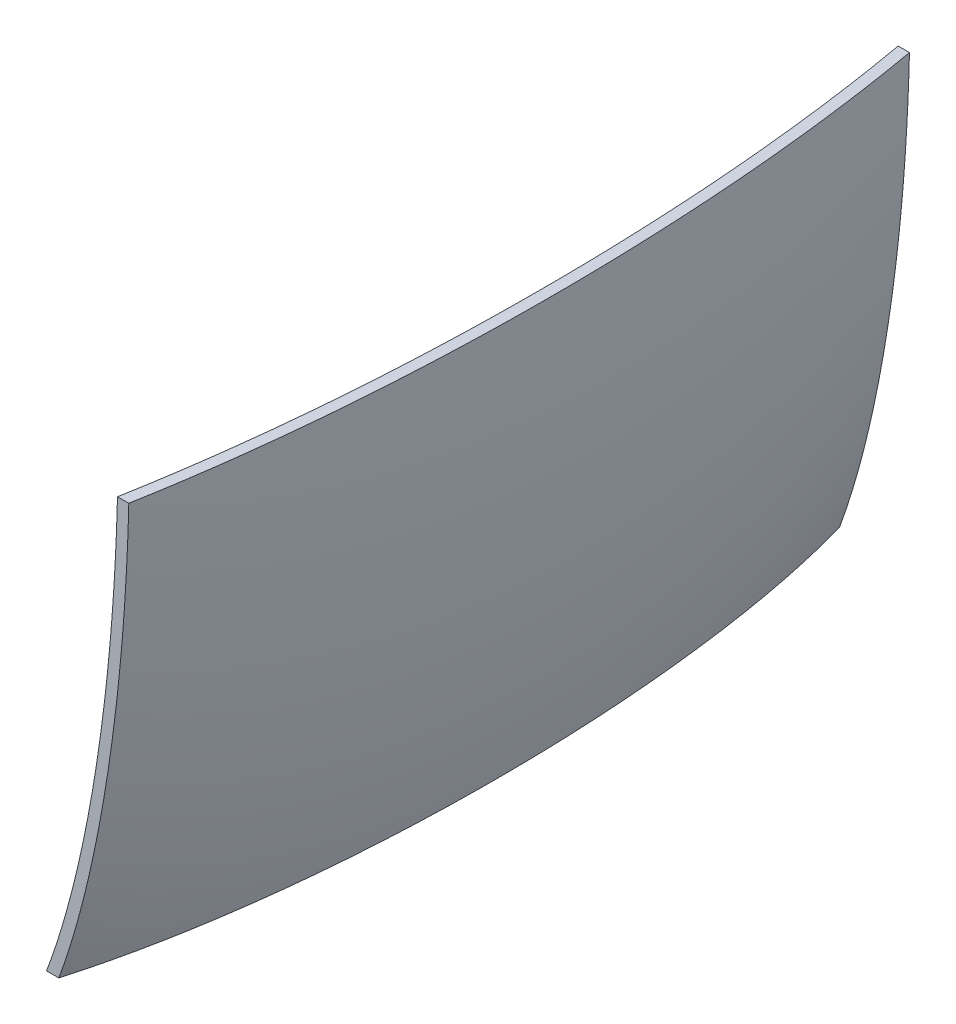
ISO-10303-21;
HEADER;
FILE_DESCRIPTION(('STEP AP214'),'2;1');
FILE_NAME('part.step','',(''),(''),'','','');
FILE_SCHEMA(('AUTOMOTIVE_DESIGN { 1 0 10303 214 1 1 1 1 }'));
ENDSEC;
DATA;
#1=APPLICATION_CONTEXT('core data for automotive mechanical design processes');
#2=APPLICATION_PROTOCOL_DEFINITION('international standard','automotive_design',2000,#1);
#3=PRODUCT_CONTEXT('',#1,'mechanical');
#4=PRODUCT('Part','Part','',(#3));
#5=PRODUCT_RELATED_PRODUCT_CATEGORY('part','',(#4));
#6=PRODUCT_DEFINITION_FORMATION('','',#4);
#7=PRODUCT_DEFINITION_CONTEXT('part definition',#1,'design');
#8=PRODUCT_DEFINITION('design','',#6,#7);
#9=PRODUCT_DEFINITION_SHAPE('','',#8);
#10=(LENGTH_UNIT() NAMED_UNIT(*) SI_UNIT(.MILLI.,.METRE.));
#11=(NAMED_UNIT(*) PLANE_ANGLE_UNIT() SI_UNIT($,.RADIAN.));
#12=(NAMED_UNIT(*) SI_UNIT($,.STERADIAN.) SOLID_ANGLE_UNIT());
#13=UNCERTAINTY_MEASURE_WITH_UNIT(LENGTH_MEASURE(1.E-05),#10,'distance_accuracy_value','');
#14=(GEOMETRIC_REPRESENTATION_CONTEXT(3) GLOBAL_UNCERTAINTY_ASSIGNED_CONTEXT((#13)) GLOBAL_UNIT_ASSIGNED_CONTEXT((#10,
#11,#12)) REPRESENTATION_CONTEXT('',''));
#15=CARTESIAN_POINT('',(0.,0.,0.));
#16=DIRECTION('',(0.,0.,1.));
#17=DIRECTION('',(1.,0.,0.));
#18=AXIS2_PLACEMENT_3D('',#15,#16,#17);
#19=CARTESIAN_POINT('',(-19.558,0.,0.));
#20=DIRECTION('',(0.,0.,1.));
#21=DIRECTION('',(0.,1.,0.));
#22=AXIS2_PLACEMENT_3D('',#19,#20,#21);
#23=ELLIPSE('',#22,66.929,19.558);
#24=TRIMMED_CURVE('',#23,(PARAMETER_VALUE(1.5707963267949)),(PARAMETER_VALUE(4.71238898038469)),
.T.,.PARAMETER.);
#25=CARTESIAN_POINT('',(-78.994,0.,0.));
#26=DIRECTION('',(-1.,0.,0.));
#27=AXIS1_PLACEMENT('',#25,#26);
#28=SURFACE_OF_REVOLUTION('',#24,#27);
#29=CARTESIAN_POINT('',(-2.95153679059233,-5.,35.));
#30=CARTESIAN_POINT('',(-2.97274859129977,-5.8246109817068,35.));
#31=CARTESIAN_POINT('',(-2.9992219123988,-6.64908921805449,35.));
#32=CARTESIAN_POINT('',(-3.06290342518978,-8.29842447092255,35.));
#33=CARTESIAN_POINT('',(-3.1001219131156,-9.12328108952281,35.));
#34=CARTESIAN_POINT('',(-3.18549616066032,-10.7730234993551,35.));
#35=CARTESIAN_POINT('',(-3.23365975722108,-11.5979088859634,35.));
#36=CARTESIAN_POINT('',(-3.34119709188108,-13.2473532917202,35.));
#37=CARTESIAN_POINT('',(-3.40057627681239,-14.0719119564002,35.));
#38=CARTESIAN_POINT('',(-3.53087605682866,-15.7203439422262,35.));
#39=CARTESIAN_POINT('',(-3.60179978132468,-16.5442170164923,35.));
#40=CARTESIAN_POINT('',(-3.75559398786525,-18.1909141672776,35.));
#41=CARTESIAN_POINT('',(-3.83846539580471,-19.0137381575069,35.));
#42=CARTESIAN_POINT('',(-4.01572527241899,-20.649462569734,35.));
#43=CARTESIAN_POINT('',(-4.10998456539371,-21.4623769631639,35.));
#44=CARTESIAN_POINT('',(-4.31127060887084,-23.0865037743427,35.));
#45=CARTESIAN_POINT('',(-4.41829544724528,-23.8977164285148,35.));
#46=CARTESIAN_POINT('',(-4.64581935100373,-25.5180765872359,35.));
#47=CARTESIAN_POINT('',(-4.76631551482277,-26.3272244982506,35.));
#48=CARTESIAN_POINT('',(-5.02164430456594,-27.9430689598173,35.));
#49=CARTESIAN_POINT('',(-5.15647358867276,-28.7497660368706,35.));
#50=CARTESIAN_POINT('',(-5.44152961985443,-30.3602882151227,35.));
#51=CARTESIAN_POINT('',(-5.59175353677753,-31.1641138161954,35.));
#52=CARTESIAN_POINT('',(-5.90891723237903,-32.768447211273,35.));
#53=CARTESIAN_POINT('',(-6.07585635330628,-33.5689551345401,35.));
#54=CARTESIAN_POINT('',(-6.35115213562646,-34.8171288824816,35.));
#55=CARTESIAN_POINT('',(-6.4532460799055,-35.2661817989724,35.));
#56=CARTESIAN_POINT('',(-6.66360284630733,-36.1628306044396,35.));
#57=CARTESIAN_POINT('',(-6.77186549176627,-36.6104265347544,35.));
#58=CARTESIAN_POINT('',(-6.99494528661374,-37.5039402873122,35.));
#59=CARTESIAN_POINT('',(-7.10976183417122,-37.949858259643,35.));
#60=CARTESIAN_POINT('',(-7.34640044560426,-38.8397818135944,35.));
#61=CARTESIAN_POINT('',(-7.46822173611184,-39.2837876005364,35.));
#62=CARTESIAN_POINT('',(-7.71988457999393,-40.1713530142595,35.));
#63=CARTESIAN_POINT('',(-7.8497549316113,-40.6149044908552,35.));
#64=CARTESIAN_POINT('',(-8.11772411874404,-41.4995447814287,35.));
#65=CARTESIAN_POINT('',(-8.25582339745031,-41.9406334613642,35.));
#66=CARTESIAN_POINT('',(-8.54099758102481,-42.820028985655,35.));
#67=CARTESIAN_POINT('',(-8.68807467364249,-43.2583351229902,35.));
#68=CARTESIAN_POINT('',(-8.9921593345595,-44.1317584187627,35.));
#69=CARTESIAN_POINT('',(-9.14917238402392,-44.5668736666411,35.));
#70=CARTESIAN_POINT('',(-9.31156498844267,-45.,35.));
#71=B_SPLINE_CURVE_WITH_KNOTS('',3,(#29,#30,#31,#32,#33,#34,#35,#36,#37,#38,#39,#40,#41,#42,#43,
#44,#45,#46,#47,#48,#49,#50,#51,#52,#53,#54,#55,#56,#57,#58,#59,#60,#61,#62,#63,#64,#65,#66,#67,
#68,#69,#70),.UNSPECIFIED.,.F.,.F.,(4,2,2,2,2,2,2,2,2,2,2,2,2,2,2,2,2,2,2,2,4),(0.,
2.4746382841265,4.95165573143128,7.43045239821724,9.91045599829125,12.391132982947,
14.8720023130102,17.3269891340028,19.7816086876659,22.2357005600459,24.6892215020335,
27.1422921947721,29.5952663959342,30.976767051917,32.3582281633224,33.7395626215007,
35.1207448633512,36.5071912424775,37.8937123599976,39.280572709871,40.6682049048954),.UNSPECIFIED.);
#72=CARTESIAN_POINT('',(-2.95153679059233,-5.,35.));
#73=VERTEX_POINT('',#72);
#74=CARTESIAN_POINT('',(-9.31156498844267,-45.,35.));
#75=VERTEX_POINT('',#74);
#76=EDGE_CURVE('E11',#73,#75,#71,.T.);
#77=ORIENTED_EDGE('',*,*,#76,.F.);
#78=CARTESIAN_POINT('',(-2.95153679059232,-5.,-35.));
#79=CARTESIAN_POINT('',(-2.8058372239561,-5.,-34.1903027117793));
#80=CARTESIAN_POINT('',(-2.66684689424863,-5.,-33.3794123935338));
#81=CARTESIAN_POINT('',(-2.40156353113196,-5.,-31.7555813775803));
#82=CARTESIAN_POINT('',(-2.27527010206376,-5.,-30.9426407445737));
#83=CARTESIAN_POINT('',(-2.03468271443708,-5.,-29.315213054115));
#84=CARTESIAN_POINT('',(-1.92038553901185,-5.,-28.5007264711684));
#85=CARTESIAN_POINT('',(-1.70317408267661,-5.,-26.8702362513182));
#86=CARTESIAN_POINT('',(-1.60025990441948,-5.,-26.0542326008011));
#87=CARTESIAN_POINT('',(-1.30782720736097,-5.,-23.6043401783721));
#88=CARTESIAN_POINT('',(-1.13460586449473,-5.,-21.9684834758059));
#89=CARTESIAN_POINT('',(-0.828897793774401,-5.,-18.6972960389232));
#90=CARTESIAN_POINT('',(-0.696306548770724,-5.,-17.0619749510813));
#91=CARTESIAN_POINT('',(-0.469082217023535,-5.,-13.7886417991186));
#92=CARTESIAN_POINT('',(-0.374450709042742,-5.,-12.1506296259186));
#93=CARTESIAN_POINT('',(-0.221694744602473,-5.,-8.87302027396048));
#94=CARTESIAN_POINT('',(-0.163567529742783,-5.,-7.23342322434081));
#95=CARTESIAN_POINT('',(-0.108196203126819,-5.,-4.98023897424788));
#96=CARTESIAN_POINT('',(-0.0956191947107344,-5.,-4.36699756039615));
#97=CARTESIAN_POINT('',(-0.0754285034913695,-5.,-3.14045703243783));
#98=CARTESIAN_POINT('',(-0.0678146142838703,-5.,-2.52715792179177));
#99=CARTESIAN_POINT('',(-0.0523849050861859,-5.,-0.686620900173499));
#100=CARTESIAN_POINT('',(-0.0519950621704221,-5.00000000000001,0.540684844885677));
#101=CARTESIAN_POINT('',(-0.074202253417557,-5.00000000000001,3.40905255384248));
#102=CARTESIAN_POINT('',(-0.104596191150822,-5.,5.05005877334993));
#103=CARTESIAN_POINT('',(-0.201198371672999,-5.,8.33116315245641));
#104=CARTESIAN_POINT('',(-0.267409801649022,-5.,9.97126121824123));
#105=CARTESIAN_POINT('',(-0.436648718734588,-5.,13.2497372126675));
#106=CARTESIAN_POINT('',(-0.539680011866924,-5.,14.8881149459143));
#107=CARTESIAN_POINT('',(-0.78411455928298,-5.,18.1613288278053));
#108=CARTESIAN_POINT('',(-0.925501590793809,-5.,19.7961661798724));
#109=CARTESIAN_POINT('',(-1.24900962349564,-5.,23.0616681348151));
#110=CARTESIAN_POINT('',(-1.43112696362046,-5.,24.6923330994122));
#111=CARTESIAN_POINT('',(-1.83937467092009,-5.00000000000001,27.9479070229697));
#112=CARTESIAN_POINT('',(-2.06549640944575,-5.00000000000001,29.5728170468948));
#113=CARTESIAN_POINT('',(-2.36504685344468,-5.00000000000001,31.5117272588724));
#114=CARTESIAN_POINT('',(-2.41508381813285,-5.00000000000001,31.8294037743736));
#115=CARTESIAN_POINT('',(-2.51707633210562,-5.,32.4644455607257));
#116=CARTESIAN_POINT('',(-2.56903185457372,-5.,32.7818108358634));
#117=CARTESIAN_POINT('',(-2.67490064000452,-5.,33.4161827306141));
#118=CARTESIAN_POINT('',(-2.72881371188117,-5.,33.7331893821358));
#119=CARTESIAN_POINT('',(-2.83865306824159,-5.,34.366859032266));
#120=CARTESIAN_POINT('',(-2.89457938584331,-5.00000000000001,34.683522025133));
#121=CARTESIAN_POINT('',(-2.95153679059233,-5.00000000000001,35.));
#122=B_SPLINE_CURVE_WITH_KNOTS('',3,(#78,#79,#80,#81,#82,#83,#84,#85,#86,#87,#88,#89,#90,#91,
#92,#93,#94,#95,#96,#97,#98,#99,#100,#101,#102,#103,#104,#105,#106,#107,#108,#109,#110,#111,
#112,#113,#114,#115,#116,#117,#118,#119,#120,#121),.UNSPECIFIED.,.F.,.F.,(4,2,2,2,2,2,2,2,2,2,2,
2,2,2,2,2,2,2,2,2,2,4),(0.,2.46805598350371,4.93603503394491,7.40335058111806,9.87068837694634,
14.8051019094279,19.7267134505617,24.6485296625394,29.5699739190074,31.4100706576087,
33.2500908661189,36.9318471540996,41.855313675354,46.7792183789018,51.7036322075583,
56.6259664665784,61.5478584565725,66.4687863028477,67.4335628011654,68.3983258194854,
69.3629949143802,70.3276798853685),.UNSPECIFIED.);
#123=CARTESIAN_POINT('',(-2.95153679059232,-5.,-35.));
#124=VERTEX_POINT('',#123);
#125=EDGE_CURVE('E47',#124,#73,#122,.T.);
#126=ORIENTED_EDGE('',*,*,#125,.F.);
#127=CARTESIAN_POINT('',(-9.31156498844266,-45.,-35.));
#128=CARTESIAN_POINT('',(-9.17401192798864,-44.6331588335263,-35.));
#129=CARTESIAN_POINT('',(-9.04032990215722,-44.264881667874,-35.));
#130=CARTESIAN_POINT('',(-8.7801485385918,-43.525824753539,-35.));
#131=CARTESIAN_POINT('',(-8.65364871246352,-43.1550451769449,-35.));
#132=CARTESIAN_POINT('',(-8.40748215793257,-42.4119921332125,-35.));
#133=CARTESIAN_POINT('',(-8.28780319796815,-42.0397227092506,-35.));
#134=CARTESIAN_POINT('',(-8.05456156676405,-41.2932696646049,-35.));
#135=CARTESIAN_POINT('',(-7.94099901416165,-40.9190860069455,-35.));
#136=CARTESIAN_POINT('',(-7.60905569846708,-39.7946864410621,-35.));
#137=CARTESIAN_POINT('',(-7.39919653419438,-39.0419439442161,-35.));
#138=CARTESIAN_POINT('',(-6.99960472813774,-37.5314237637213,-35.));
#139=CARTESIAN_POINT('',(-6.80986592310628,-36.7736476979703,-35.));
#140=CARTESIAN_POINT('',(-6.44835954064864,-35.2538364830464,-35.));
#141=CARTESIAN_POINT('',(-6.27659187084598,-34.4918013557874,-35.));
#142=CARTESIAN_POINT('',(-5.9504004582418,-32.9690651513357,-35.));
#143=CARTESIAN_POINT('',(-5.7958741960843,-32.2083859529862,-35.));
#144=CARTESIAN_POINT('',(-5.50157156231293,-30.6839490049983,-35.));
#145=CARTESIAN_POINT('',(-5.36179966129799,-29.9201903946546,-35.));
#146=CARTESIAN_POINT('',(-5.09595172473797,-28.390102205031,-35.));
#147=CARTESIAN_POINT('',(-4.96987913366745,-27.6237720288722,-35.));
#148=CARTESIAN_POINT('',(-4.73056944891566,-26.0890169178072,-35.));
#149=CARTESIAN_POINT('',(-4.61733396140133,-25.3205917330657,-35.));
#150=CARTESIAN_POINT('',(-4.40298759973995,-23.7820983312608,-35.));
#151=CARTESIAN_POINT('',(-4.30187606232383,-23.0120302064262,-35.));
#152=CARTESIAN_POINT('',(-4.11823204266214,-21.5276373794508,-35.));
#153=CARTESIAN_POINT('',(-4.03487781406214,-20.8134140124199,-35.));
#154=CARTESIAN_POINT('',(-3.87764204738331,-19.3840688418336,-35.));
#155=CARTESIAN_POINT('',(-3.80375864829961,-18.6689472427537,-35.));
#156=CARTESIAN_POINT('',(-3.66511029624754,-17.2379033809207,-35.));
#157=CARTESIAN_POINT('',(-3.60034431821671,-16.5219812173114,-35.));
#158=CARTESIAN_POINT('',(-3.47963643576806,-15.0894275453294,-35.));
#159=CARTESIAN_POINT('',(-3.42369412690398,-14.3727960709852,-35.));
#160=CARTESIAN_POINT('',(-3.32015005608541,-12.9355721961973,-35.));
#161=CARTESIAN_POINT('',(-3.27258840791353,-12.2149769097484,-35.));
#162=CARTESIAN_POINT('',(-3.18592636802046,-10.773237385178,-35.));
#163=CARTESIAN_POINT('',(-3.14682645660323,-10.0520931182257,-35.));
#164=CARTESIAN_POINT('',(-3.07692735817927,-8.60933640691701,-35.));
#165=CARTESIAN_POINT('',(-3.04612893754222,-7.88772392549641,-35.));
#166=CARTESIAN_POINT('',(-2.99271912091858,-6.44410846070848,-35.));
#167=CARTESIAN_POINT('',(-2.97010871516978,-5.72210544067775,-35.));
#168=CARTESIAN_POINT('',(-2.95153679059232,-4.99999999999999,-35.));
#169=B_SPLINE_CURVE_WITH_KNOTS('',3,(#127,#128,#129,#130,#131,#132,#133,#134,#135,#136,#137,
#138,#139,#140,#141,#142,#143,#144,#145,#146,#147,#148,#149,#150,#151,#152,#153,#154,#155,#156,
#157,#158,#159,#160,#161,#162,#163,#164,#165,#166,#167,#168),.UNSPECIFIED.,.F.,.F.,(4,2,2,2,2,2,
2,2,2,2,2,2,2,2,2,2,2,2,2,2,4),(0.,1.17530347061328,2.35052692386306,3.52357191568668,
4.696639652363,7.0406351293352,9.38391050925987,11.7271738435285,14.0556638008908,
16.3848572820152,18.7146350534154,21.0447040035593,23.3746454236109,25.5317936320788,
27.6885173120165,29.8449983196987,32.0013804530583,34.1678191167854,36.3343807193774,
38.5011422642391,40.6681657643171),.UNSPECIFIED.);
#170=CARTESIAN_POINT('',(-9.31156498844266,-45.,-35.));
#171=VERTEX_POINT('',#170);
#172=EDGE_CURVE('E96',#171,#124,#169,.T.);
#173=ORIENTED_EDGE('',*,*,#172,.F.);
#174=CARTESIAN_POINT('',(-9.31156498844267,-45.,35.));
#175=CARTESIAN_POINT('',(-9.20201622788563,-45.,34.6243836937968));
#176=CARTESIAN_POINT('',(-9.09569015406501,-45.,34.2478361474044));
#177=CARTESIAN_POINT('',(-8.88907869029365,-45.,33.4931023418175));
#178=CARTESIAN_POINT('',(-8.78879305940725,-45.,33.1149161486296));
#179=CARTESIAN_POINT('',(-8.59400356994704,-45.,32.357699232179));
#180=CARTESIAN_POINT('',(-8.4994908011859,-45.,31.9786707968442));
#181=CARTESIAN_POINT('',(-8.31573740884987,-45.,31.2193368982259));
#182=CARTESIAN_POINT('',(-8.22649684512673,-45.,30.8390314204967));
#183=CARTESIAN_POINT('',(-7.96637589896978,-45.,29.6970907509903));
#184=CARTESIAN_POINT('',(-7.80292344679823,-45.,28.9337545882824));
#185=CARTESIAN_POINT('',(-7.49392347987995,-45.,27.403811859584));
#186=CARTESIAN_POINT('',(-7.34836882108184,-45.,26.6372067256856));
#187=CARTESIAN_POINT('',(-7.07355383959731,-45.,25.1011690469837));
#188=CARTESIAN_POINT('',(-6.94429185880368,-45.,24.3317367981114));
#189=CARTESIAN_POINT('',(-6.70199288588815,-45.,22.7979980001007));
#190=CARTESIAN_POINT('',(-6.5888103531706,-45.,22.0337143570044));
#191=CARTESIAN_POINT('',(-6.3761991404982,-45.,20.5030215297286));
#192=CARTESIAN_POINT('',(-6.2767743525562,-45.,19.7366118063827));
#193=CARTESIAN_POINT('',(-6.09090217571897,-45.,18.2019689676987));
#194=CARTESIAN_POINT('',(-6.0044590683448,-45.,17.4337353353007));
#195=CARTESIAN_POINT('',(-5.84392631873704,-45.,15.8957278720747));
#196=CARTESIAN_POINT('',(-5.76984070448359,-45.,15.1259536214937));
#197=CARTESIAN_POINT('',(-5.63352644620907,-45.,13.5851409653207));
#198=CARTESIAN_POINT('',(-5.57130119455179,-45.,12.8141022614766));
#199=CARTESIAN_POINT('',(-5.41959365585954,-45.,10.7424618104066));
#200=CARTESIAN_POINT('',(-5.34065727572124,-45.,9.441075641067));
#201=CARTESIAN_POINT('',(-5.21391457739583,-45.,6.8367455419836));
#202=CARTESIAN_POINT('',(-5.16610983032187,-45.,5.53380153694472));
#203=CARTESIAN_POINT('',(-5.10083004883735,-45.,2.92722445382819));
#204=CARTESIAN_POINT('',(-5.08335339243085,-45.,1.62359141633144));
#205=CARTESIAN_POINT('',(-5.07843319993232,-45.,-0.983718353488174));
#206=CARTESIAN_POINT('',(-5.09098937708888,-45.,-2.28739508527501));
#207=CARTESIAN_POINT('',(-5.14632920726666,-45.,-4.89342323459884));
#208=CARTESIAN_POINT('',(-5.18909699261591,-45.,-6.19577498860737));
#209=CARTESIAN_POINT('',(-5.30556073966099,-45.,-8.79909875742483));
#210=CARTESIAN_POINT('',(-5.37925634128339,-45.,-10.1000707881202));
#211=CARTESIAN_POINT('',(-5.53016669717546,-45.,-12.2841086389475));
#212=CARTESIAN_POINT('',(-5.59872053222429,-45.,-13.1677801097047));
#213=CARTESIAN_POINT('',(-5.75134734626881,-45.,-14.9338042219115));
#214=CARTESIAN_POINT('',(-5.83542057220683,-45.,-15.8161568421504));
#215=CARTESIAN_POINT('',(-6.01985331265882,-45.,-17.5792296719394));
#216=CARTESIAN_POINT('',(-6.12021404674162,-45.,-18.4599497542505));
#217=CARTESIAN_POINT('',(-6.33821213623521,-45.,-20.2194013196196));
#218=CARTESIAN_POINT('',(-6.45585228329528,-45.,-21.0981324580082));
#219=CARTESIAN_POINT('',(-6.70963180428145,-45.,-22.8528815177715));
#220=CARTESIAN_POINT('',(-6.84577015855845,-45.,-23.7288995859744));
#221=CARTESIAN_POINT('',(-7.13811041801011,-45.,-25.4774407881954));
#222=CARTESIAN_POINT('',(-7.29430896014164,-45.,-26.349964482811));
#223=CARTESIAN_POINT('',(-7.62923098174009,-45.,-28.0929522604028));
#224=CARTESIAN_POINT('',(-7.80800916726272,-45.,-28.9634059263946));
#225=CARTESIAN_POINT('',(-8.09487127025504,-45.,-30.2650259235859));
#226=CARTESIAN_POINT('',(-8.19361764924974,-45.,-30.6982618930639));
#227=CARTESIAN_POINT('',(-8.39776585816153,-45.,-31.5631604531224));
#228=CARTESIAN_POINT('',(-8.50316758301021,-45.,-31.9948230684278));
#229=CARTESIAN_POINT('',(-8.7211736780197,-45.,-32.8566428051587));
#230=CARTESIAN_POINT('',(-8.83378290575605,-45.,-33.286798700723));
#231=CARTESIAN_POINT('',(-9.06673119067805,-45.,-34.1450357371566));
#232=CARTESIAN_POINT('',(-9.1870706723919,-45.,-34.573116762688));
#233=CARTESIAN_POINT('',(-9.31156498844266,-45.,-35.));
#234=B_SPLINE_CURVE_WITH_KNOTS('',3,(#174,#175,#176,#177,#178,#179,#180,#181,#182,#183,#184,
#185,#186,#187,#188,#189,#190,#191,#192,#193,#194,#195,#196,#197,#198,#199,#200,#201,#202,#203,
#204,#205,#206,#207,#208,#209,#210,#211,#212,#213,#214,#215,#216,#217,#218,#219,#220,#221,#222,
#223,#224,#225,#226,#227,#228,#229,#230,#231,#232,#233),.UNSPECIFIED.,.F.,.F.,(4,2,2,2,2,2,2,2,
2,2,2,2,2,2,2,2,2,2,2,2,2,2,2,2,2,2,2,2,2,4),(0.,1.17376926642269,2.34749168356473,
3.5193541763743,4.69122996998535,7.03288687720268,9.37360603754918,11.7140867900396,
14.0318101886054,16.3501879275085,18.6693286250886,20.9892237859553,23.3097815030583,
27.2206945751941,31.1318050032128,35.0427062521957,38.9535701603146,42.8623815391365,
46.7711474113496,49.4300061196201,52.0889071389175,54.7480073421639,57.4075376211791,
60.0669213622962,62.7258598445856,65.3913686444189,66.724366585564,68.0573434878343,
69.3912284221796,70.7251866732211),.UNSPECIFIED.);
#235=EDGE_CURVE('E94',#75,#171,#234,.T.);
#236=ORIENTED_EDGE('',*,*,#235,.F.);
#237=EDGE_LOOP('',(#77,#126,#173,#236));
#238=FACE_BOUND('',#237,.T.);
#239=ADVANCED_FACE('F33',(#238),#28,.T.);
#240=CARTESIAN_POINT('',(-19.558,-45.,35.));
#241=DIRECTION('',(0.,0.,1.));
#242=DIRECTION('',(1.,0.,0.));
#243=AXIS2_PLACEMENT_3D('',#240,#241,#242);
#244=PLANE('',#243);
#245=DIRECTION('',(1.,0.,0.));
#246=VECTOR('',#245,1.);
#247=CARTESIAN_POINT('',(-19.558,-5.,35.));
#248=LINE('',#247,#246);
#249=CARTESIAN_POINT('',(-1.93528063907787,-5.,35.));
#250=VERTEX_POINT('',#249);
#251=EDGE_CURVE('E82',#73,#250,#248,.T.);
#252=ORIENTED_EDGE('',*,*,#251,.F.);
#253=ORIENTED_EDGE('',*,*,#76,.T.);
#254=DIRECTION('',(1.,0.,0.));
#255=VECTOR('',#254,1.);
#256=CARTESIAN_POINT('',(-19.558,-45.,35.));
#257=LINE('',#256,#255);
#258=CARTESIAN_POINT('',(-8.20713445388714,-45.,35.));
#259=VERTEX_POINT('',#258);
#260=EDGE_CURVE('E59',#75,#259,#257,.T.);
#261=ORIENTED_EDGE('',*,*,#260,.T.);
#262=CARTESIAN_POINT('',(-1.93528063907787,-5.,35.));
#263=CARTESIAN_POINT('',(-1.95658834650715,-5.83420925770023,35.));
#264=CARTESIAN_POINT('',(-1.9832418590981,-6.66828461995508,35.));
#265=CARTESIAN_POINT('',(-2.04745615238763,-8.33683426261232,35.));
#266=CARTESIAN_POINT('',(-2.08502760554952,-9.17130813189027,35.));
#267=CARTESIAN_POINT('',(-2.17128399637742,-10.8402963622214,35.));
#268=CARTESIAN_POINT('',(-2.21997706564272,-11.674810304002,35.));
#269=CARTESIAN_POINT('',(-2.32875720940909,-13.3435140477495,35.));
#270=CARTESIAN_POINT('',(-2.38884994724265,-14.1777034812105,35.));
#271=CARTESIAN_POINT('',(-2.52076631989351,-15.845390235754,35.));
#272=CARTESIAN_POINT('',(-2.5925932221732,-16.6788872988803,35.));
#273=CARTESIAN_POINT('',(-2.74838627538064,-18.3448168479658,35.));
#274=CARTESIAN_POINT('',(-2.83235341182366,-19.1772492419578,35.));
#275=CARTESIAN_POINT('',(-3.01201003021765,-20.8322770259435,35.));
#276=CARTESIAN_POINT('',(-3.10757147392154,-21.6548862880542,35.));
#277=CARTESIAN_POINT('',(-3.31166156921138,-23.29837078973,35.));
#278=CARTESIAN_POINT('',(-3.42018823741407,-24.1192462750207,35.));
#279=CARTESIAN_POINT('',(-3.65091976756135,-25.7588919236538,35.));
#280=CARTESIAN_POINT('',(-3.77312159727318,-26.5776625126943,35.));
#281=CARTESIAN_POINT('',(-4.03207436940314,-28.2127033486322,35.));
#282=CARTESIAN_POINT('',(-4.16882178208723,-29.0289741529056,35.));
#283=CARTESIAN_POINT('',(-4.45794341360363,-30.6585845919215,35.));
#284=CARTESIAN_POINT('',(-4.6103145684685,-31.4719247691259,35.));
#285=CARTESIAN_POINT('',(-4.9320359645574,-33.0952153575599,35.));
#286=CARTESIAN_POINT('',(-5.10138529955416,-33.9051659473106,35.));
#287=CARTESIAN_POINT('',(-5.37615816641265,-35.1477191318938,35.));
#288=CARTESIAN_POINT('',(-5.47497200551974,-35.5817901778893,35.));
#289=CARTESIAN_POINT('',(-5.67828980239264,-36.4485904618482,35.));
#290=CARTESIAN_POINT('',(-5.78279362916165,-36.8813197304604,35.));
#291=CARTESIAN_POINT('',(-5.997823228635,-37.7452462322998,35.));
#292=CARTESIAN_POINT('',(-6.10834854660501,-38.1764435786033,35.));
#293=CARTESIAN_POINT('',(-6.33580641134007,-39.0371057614896,35.));
#294=CARTESIAN_POINT('',(-6.45273837846389,-39.4665707510451,35.));
#295=CARTESIAN_POINT('',(-6.69389021639031,-40.3250980682523,35.));
#296=CARTESIAN_POINT('',(-6.8181344865916,-40.7541535536,35.));
#297=CARTESIAN_POINT('',(-7.07405981547224,-41.6100653306793,35.));
#298=CARTESIAN_POINT('',(-7.20574121616258,-42.0369215202853,35.));
#299=CARTESIAN_POINT('',(-7.47716123315292,-42.8881677925189,35.));
#300=CARTESIAN_POINT('',(-7.61690148371878,-43.3125573555916,35.));
#301=CARTESIAN_POINT('',(-7.90521740414455,-44.1585377219924,35.));
#302=CARTESIAN_POINT('',(-8.05379707820109,-44.5801271592659,35.));
#303=CARTESIAN_POINT('',(-8.20713445388719,-44.9999999999999,35.));
#304=B_SPLINE_CURVE_WITH_KNOTS('',3,(#262,#263,#264,#265,#266,#267,#268,#269,#270,#271,#272,
#273,#274,#275,#276,#277,#278,#279,#280,#281,#282,#283,#284,#285,#286,#287,#288,#289,#290,#291,
#292,#293,#294,#295,#296,#297,#298,#299,#300,#301,#302,#303),.UNSPECIFIED.,.F.,.F.,(4,2,2,2,2,2,
2,2,2,2,2,2,2,2,2,2,2,2,2,2,4),(0.,2.50343075925804,5.00931694212059,7.51704120897166,
10.0260145864106,12.5356878000773,15.0455648575374,17.5298907958944,20.0138371746008,
22.4972338680033,24.9800292917445,27.4623387430802,29.9445157691473,31.2800124506134,
32.6154783988186,33.9508436339818,35.2860882509151,36.6260731879893,37.9661197971453,
39.3064391184607,40.6473702876222),.UNSPECIFIED.);
#305=EDGE_CURVE('E87',#250,#259,#304,.T.);
#306=ORIENTED_EDGE('',*,*,#305,.F.);
#307=EDGE_LOOP('',(#252,#253,#261,#306));
#308=FACE_BOUND('',#307,.T.);
#309=ADVANCED_FACE('F86',(#308),#244,.T.);
#310=CARTESIAN_POINT('',(-19.558,-5.,-35.));
#311=DIRECTION('',(0.,1.,0.));
#312=DIRECTION('',(0.,0.,1.));
#313=AXIS2_PLACEMENT_3D('',#310,#311,#312);
#314=PLANE('',#313);
#315=DIRECTION('',(1.,0.,0.));
#316=VECTOR('',#315,1.);
#317=CARTESIAN_POINT('',(-19.558,-5.,-35.));
#318=LINE('',#317,#316);
#319=CARTESIAN_POINT('',(-1.93528063907786,-5.,-35.));
#320=VERTEX_POINT('',#319);
#321=EDGE_CURVE('E148',#124,#320,#318,.T.);
#322=ORIENTED_EDGE('',*,*,#321,.F.);
#323=ORIENTED_EDGE('',*,*,#125,.T.);
#324=ORIENTED_EDGE('',*,*,#251,.T.);
#325=CARTESIAN_POINT('',(-1.93528063907786,-5.,-35.));
#326=CARTESIAN_POINT('',(-1.82554434772448,-5.,-34.3858851132785));
#327=CARTESIAN_POINT('',(-1.71963059814073,-5.,-33.7710921125588));
#328=CARTESIAN_POINT('',(-1.51512387869548,-5.,-32.5402981737668));
#329=CARTESIAN_POINT('',(-1.41653080278078,-5.,-31.9242972533262));
#330=CARTESIAN_POINT('',(-1.22636383238003,-5.,-30.6913856630293));
#331=CARTESIAN_POINT('',(-1.13478803593492,-5.,-30.0744752862056));
#332=CARTESIAN_POINT('',(-0.958356623231549,-5.,-28.8396947779162));
#333=CARTESIAN_POINT('',(-0.873501034847709,-5.,-28.2218246424805));
#334=CARTESIAN_POINT('',(-0.628677573182675,-5.,-26.3670439433107));
#335=CARTESIAN_POINT('',(-0.478433873045691,-5.,-25.1288383767043));
#336=CARTESIAN_POINT('',(-0.20226598086454,-5.,-22.649729950343));
#337=CARTESIAN_POINT('',(-0.0763419823103867,-5.,-21.4088270692075));
#338=CARTESIAN_POINT('',(0.152412061659671,-5.,-18.9262685769271));
#339=CARTESIAN_POINT('',(0.255267229995734,-5.,-17.6846152757706));
#340=CARTESIAN_POINT('',(0.439012558450157,-5.,-15.1996314871905));
#341=CARTESIAN_POINT('',(0.519901696957782,-5.,-13.9563009244614));
#342=CARTESIAN_POINT('',(0.660359439907751,-5.,-11.468447544267));
#343=CARTESIAN_POINT('',(0.719928155379618,-5.,-10.2239247330443));
#344=CARTESIAN_POINT('',(0.818265612632638,-5.,-7.73415662705298));
#345=CARTESIAN_POINT('',(0.857036070677108,-5.00000000000001,-6.48891140038974));
#346=CARTESIAN_POINT('',(0.899799457791377,-5.00000000000001,-4.62288590164434));
#347=CARTESIAN_POINT('',(0.911481446024627,-5.,-4.00227228375634));
#348=CARTESIAN_POINT('',(0.929792082539124,-5.,-2.76099961013983));
#349=CARTESIAN_POINT('',(0.936420979756926,-5.,-2.14034055815633));
#350=CARTESIAN_POINT('',(0.944641707583796,-5.,-0.898982040980339));
#351=CARTESIAN_POINT('',(0.946233481376275,-5.,-0.278282575410978));
#352=CARTESIAN_POINT('',(0.944381203188275,-5.,0.963138923219218));
#353=CARTESIAN_POINT('',(0.940936892246932,-5.,1.58386095579921));
#354=CARTESIAN_POINT('',(0.921787950068132,-4.99999999999999,3.57673992648199));
#355=CARTESIAN_POINT('',(0.896288446880363,-5.,4.94881695622164));
#356=CARTESIAN_POINT('',(0.820381792219472,-5.,7.69241648251823));
#357=CARTESIAN_POINT('',(0.769972078629312,-5.,9.06393890750609));
#358=CARTESIAN_POINT('',(0.643689727073169,-5.,11.8058333528319));
#359=CARTESIAN_POINT('',(0.567816794690547,-5.,13.1762053596846));
#360=CARTESIAN_POINT('',(0.389855437486242,-5.,15.9151807251951));
#361=CARTESIAN_POINT('',(0.287768375789053,-5.,17.2837841720994));
#362=CARTESIAN_POINT('',(0.0561754954338703,-5.,20.0203306358147));
#363=CARTESIAN_POINT('',(-0.0733631183746677,-5.,21.3882708835616));
#364=CARTESIAN_POINT('',(-0.361395174499832,-5.,24.1211091965858));
#365=CARTESIAN_POINT('',(-0.519888208002896,-5.,25.4860073045404));
#366=CARTESIAN_POINT('',(-0.780931501429227,-5.,27.5304255413293));
#367=CARTESIAN_POINT('',(-0.871835481394023,-5.,28.2114471831279));
#368=CARTESIAN_POINT('',(-1.06170658181513,-5.,29.5723658676284));
#369=CARTESIAN_POINT('',(-1.16067365995766,-5.,30.252262916213));
#370=CARTESIAN_POINT('',(-1.36705026318904,-5.,31.6109939263769));
#371=CARTESIAN_POINT('',(-1.47446241983932,-5.,32.2898274888194));
#372=CARTESIAN_POINT('',(-1.69813145030927,-5.,33.6460477746605));
#373=CARTESIAN_POINT('',(-1.81438848705047,-5.,34.3234344711717));
#374=CARTESIAN_POINT('',(-1.93528063907787,-5.,35.));
#375=B_SPLINE_CURVE_WITH_KNOTS('',3,(#325,#326,#327,#328,#329,#330,#331,#332,#333,#334,#335,
#336,#337,#338,#339,#340,#341,#342,#343,#344,#345,#346,#347,#348,#349,#350,#351,#352,#353,#354,
#355,#356,#357,#358,#359,#360,#361,#362,#363,#364,#365,#366,#367,#368,#369,#370,#371,#372,#373,
#374),.UNSPECIFIED.,.F.,.F.,(4,2,2,2,2,2,2,2,2,2,2,2,2,2,2,2,2,2,2,2,2,2,2,2,4),(0.,
1.87150738542387,3.74298765339143,5.61395886905284,7.48493784481905,11.2265173673603,
14.9681266570618,18.705641175724,22.4433294914399,26.1809983422613,29.9183587147827,
31.7805125950895,33.6425747319199,35.5046578719367,37.3668367656277,41.4835338750674,
45.6006544918035,49.7178227140914,53.8347768885778,57.9566774149038,62.0785197477438,
64.139665679553,66.2008007955145,68.2625807445611,70.3243986805247),.UNSPECIFIED.);
#376=EDGE_CURVE('E93',#320,#250,#375,.T.);
#377=ORIENTED_EDGE('',*,*,#376,.F.);
#378=EDGE_LOOP('',(#322,#323,#324,#377));
#379=FACE_BOUND('',#378,.T.);
#380=ADVANCED_FACE('F114',(#379),#314,.T.);
#381=CARTESIAN_POINT('',(-19.558,-45.,-35.));
#382=DIRECTION('',(0.,0.,-1.));
#383=DIRECTION('',(-1.,0.,0.));
#384=AXIS2_PLACEMENT_3D('',#381,#382,#383);
#385=PLANE('',#384);
#386=DIRECTION('',(1.,0.,0.));
#387=VECTOR('',#386,1.);
#388=CARTESIAN_POINT('',(-19.558,-45.,-35.));
#389=LINE('',#388,#387);
#390=CARTESIAN_POINT('',(-8.20713445388712,-44.9999999999999,-34.9999999999999));
#391=VERTEX_POINT('',#390);
#392=EDGE_CURVE('E54',#171,#391,#389,.T.);
#393=ORIENTED_EDGE('',*,*,#392,.F.);
#394=ORIENTED_EDGE('',*,*,#172,.T.);
#395=ORIENTED_EDGE('',*,*,#321,.T.);
#396=CARTESIAN_POINT('',(-8.20713445388712,-44.9999999999999,-34.9999999999999));
#397=CARTESIAN_POINT('',(-8.07046604720911,-44.625790344219,-35.));
#398=CARTESIAN_POINT('',(-7.93758368412546,-44.2502115777209,-35.));
#399=CARTESIAN_POINT('',(-7.67890316919087,-43.4967702639518,-35.));
#400=CARTESIAN_POINT('',(-7.55310250376237,-43.118908580387,-35.));
#401=CARTESIAN_POINT('',(-7.30802045372833,-42.3611493546621,-35.));
#402=CARTESIAN_POINT('',(-7.18873801807557,-41.9812521516364,-35.));
#403=CARTESIAN_POINT('',(-6.95623196573282,-41.2196258488433,-35.));
#404=CARTESIAN_POINT('',(-6.84300812199141,-40.8378968183105,-35.));
#405=CARTESIAN_POINT('',(-6.62258200448515,-40.074048928554,-35.));
#406=CARTESIAN_POINT('',(-6.51536137151021,-39.6919353601609,-35.));
#407=CARTESIAN_POINT('',(-6.3062014300097,-38.9262388465461,-35.));
#408=CARTESIAN_POINT('',(-6.2042624875,-38.5426558014641,-35.));
#409=CARTESIAN_POINT('',(-6.0053692784879,-37.774177408015,-35.));
#410=CARTESIAN_POINT('',(-5.90841529272162,-37.3892819870382,-35.));
#411=CARTESIAN_POINT('',(-5.71923494078044,-36.6183288257386,-35.));
#412=CARTESIAN_POINT('',(-5.62700863575861,-36.2322710704493,-35.));
#413=CARTESIAN_POINT('',(-5.34226082678911,-35.0089552348609,-35.));
#414=CARTESIAN_POINT('',(-5.158002463748,-34.1697625095891,-35.));
#415=CARTESIAN_POINT('',(-4.80848710214928,-32.4873827687648,-35.));
#416=CARTESIAN_POINT('',(-4.64323172197307,-31.6441954193694,-35.));
#417=CARTESIAN_POINT('',(-4.33008211287777,-29.9543854798011,-35.));
#418=CARTESIAN_POINT('',(-4.18219236898221,-29.1077620603482,-35.));
#419=CARTESIAN_POINT('',(-3.90246560662792,-27.4116070324206,-35.));
#420=CARTESIAN_POINT('',(-3.77063357301623,-26.5620746046108,-35.));
#421=CARTESIAN_POINT('',(-3.52198500770003,-24.8605792394593,-35.));
#422=CARTESIAN_POINT('',(-3.40517266651327,-24.0086156913102,-35.));
#423=CARTESIAN_POINT('',(-3.18572519386306,-22.3027054183996,-35.));
#424=CARTESIAN_POINT('',(-3.08309275033398,-21.4487583487522,-35.));
#425=CARTESIAN_POINT('',(-2.89026901408979,-19.7299120771823,-35.));
#426=CARTESIAN_POINT('',(-2.80022766517107,-18.8649960895793,-35.));
#427=CARTESIAN_POINT('',(-2.63336050536323,-17.1339854012319,-35.));
#428=CARTESIAN_POINT('',(-2.55653329920469,-16.2678908346781,-35.));
#429=CARTESIAN_POINT('',(-2.41562579049891,-14.5349739333535,-35.));
#430=CARTESIAN_POINT('',(-2.35154101847089,-13.6681519612365,-35.));
#431=CARTESIAN_POINT('',(-2.23573463828916,-11.9342259202099,-35.));
#432=CARTESIAN_POINT('',(-2.18400536283852,-11.067122362368,-35.));
#433=CARTESIAN_POINT('',(-2.09259095525371,-9.33307507076262,-35.));
#434=CARTESIAN_POINT('',(-2.05289488361497,-8.46613191224207,-35.));
#435=CARTESIAN_POINT('',(-1.98531372170185,-6.73284017786054,-35.));
#436=CARTESIAN_POINT('',(-1.95741433495433,-5.86649215999563,-35.));
#437=CARTESIAN_POINT('',(-1.93528063907786,-5.,-35.));
#438=B_SPLINE_CURVE_WITH_KNOTS('',3,(#396,#397,#398,#399,#400,#401,#402,#403,#404,#405,#406,
#407,#408,#409,#410,#411,#412,#413,#414,#415,#416,#417,#418,#419,#420,#421,#422,#423,#424,#425,
#426,#427,#428,#429,#430,#431,#432,#433,#434,#435,#436,#437),.UNSPECIFIED.,.F.,.F.,(4,2,2,2,2,2,
2,2,2,2,2,2,2,2,2,2,2,2,2,2,4),(0.,1.19511790764925,2.38980891028795,3.58430670026419,
4.77875969391775,5.96933409706723,7.1599908957858,8.35071467504068,9.54145385255888,
12.1187305296958,14.6962265372595,17.2743867774165,19.8533453353856,22.4330218727128,
25.0131867432919,27.6218514550364,30.2302405509037,32.8377131193363,35.4435633723221,
38.0470374668346,40.6473472888633),.UNSPECIFIED.);
#439=EDGE_CURVE('E81',#391,#320,#438,.T.);
#440=ORIENTED_EDGE('',*,*,#439,.F.);
#441=EDGE_LOOP('',(#393,#394,#395,#440));
#442=FACE_BOUND('',#441,.T.);
#443=ADVANCED_FACE('F134',(#442),#385,.T.);
#444=CARTESIAN_POINT('',(-19.558,-45.,-35.));
#445=DIRECTION('',(0.,-1.,0.));
#446=DIRECTION('',(0.,0.,-1.));
#447=AXIS2_PLACEMENT_3D('',#444,#445,#446);
#448=PLANE('',#447);
#449=ORIENTED_EDGE('',*,*,#260,.F.);
#450=ORIENTED_EDGE('',*,*,#235,.T.);
#451=ORIENTED_EDGE('',*,*,#392,.T.);
#452=CARTESIAN_POINT('',(-8.20713445388714,-44.9999999999999,35.));
#453=CARTESIAN_POINT('',(-8.09856819734226,-45.,34.6178150130221));
#454=CARTESIAN_POINT('',(-7.99315694984958,-45.,34.2347413438372));
#455=CARTESIAN_POINT('',(-7.78828852344181,-45.,33.4671088383789));
#456=CARTESIAN_POINT('',(-7.68882983118888,-45.,33.0825504062751));
#457=CARTESIAN_POINT('',(-7.4954675961049,-45.,32.3120933407381));
#458=CARTESIAN_POINT('',(-7.40156336084558,-45.,31.926194880732));
#459=CARTESIAN_POINT('',(-7.21897887039248,-45.,31.1531800694791));
#460=CARTESIAN_POINT('',(-7.13029842669972,-45.,30.7660637627096));
#461=CARTESIAN_POINT('',(-6.95784441167457,-45.,29.9906074116304));
#462=CARTESIAN_POINT('',(-6.87407246321126,-45.,29.6022670068258));
#463=CARTESIAN_POINT('',(-6.71121208075229,-45.,28.8245841184596));
#464=CARTESIAN_POINT('',(-6.63212390654291,-45.,28.4352415805619));
#465=CARTESIAN_POINT('',(-6.47840807602768,-45.,27.6556528326287));
#466=CARTESIAN_POINT('',(-6.40378068759171,-45.,27.2654065697834));
#467=CARTESIAN_POINT('',(-6.25879464605353,-45.,26.4841071659616));
#468=CARTESIAN_POINT('',(-6.18843618562217,-45.,26.0930539893889));
#469=CARTESIAN_POINT('',(-5.89991724908314,-45.,24.4400409733473));
#470=CARTESIAN_POINT('',(-5.70091535185988,-45.,23.174692282592));
#471=CARTESIAN_POINT('',(-5.34057194040468,-45.,20.6383499599177));
#472=CARTESIAN_POINT('',(-5.17924150227938,-45.,19.3673547794764));
#473=CARTESIAN_POINT('',(-4.8909534575121,-45.,16.8210020508726));
#474=CARTESIAN_POINT('',(-4.76400880876129,-45.,15.5456430410719));
#475=CARTESIAN_POINT('',(-4.54217244348741,-45.,12.9918307707043));
#476=CARTESIAN_POINT('',(-4.44728896854001,-45.,11.7133767994863));
#477=CARTESIAN_POINT('',(-4.2879739813393,-45.,9.15455642732786));
#478=CARTESIAN_POINT('',(-4.2235430994066,-45.,7.87418998735263));
#479=CARTESIAN_POINT('',(-4.12398527055742,-45.,5.30972678706942));
#480=CARTESIAN_POINT('',(-4.08891795317042,-45.,4.02562772438961));
#481=CARTESIAN_POINT('',(-4.04775902092142,-45.,1.45732560762786));
#482=CARTESIAN_POINT('',(-4.04165934307544,-45.,0.173122681991162));
#483=CARTESIAN_POINT('',(-4.05831727079165,-45.,-2.3948611297991));
#484=CARTESIAN_POINT('',(-4.08106955489086,-45.,-3.67864205010884));
#485=CARTESIAN_POINT('',(-4.15577581531501,-45.,-6.24524189771401));
#486=CARTESIAN_POINT('',(-4.20772722316448,-45.,-7.5280608996867));
#487=CARTESIAN_POINT('',(-4.34166374348289,-45.,-10.0922117196445));
#488=CARTESIAN_POINT('',(-4.42365024035572,-45.,-11.3735434663463));
#489=CARTESIAN_POINT('',(-4.57901555276739,-45.,-13.4091742212115));
#490=CARTESIAN_POINT('',(-4.6421529794298,-45.,-14.1642665278291));
#491=CARTESIAN_POINT('',(-4.77977889224281,-45.,-15.6734036027424));
#492=CARTESIAN_POINT('',(-4.85426710220808,-45.,-16.4274483960756));
#493=CARTESIAN_POINT('',(-5.01506827079213,-45.,-17.9341878677757));
#494=CARTESIAN_POINT('',(-5.1013798310118,-45.,-18.6868826951587));
#495=CARTESIAN_POINT('',(-5.28641076437755,-45.,-20.1906137366876));
#496=CARTESIAN_POINT('',(-5.38512792466192,-45.,-20.9416502223899));
#497=CARTESIAN_POINT('',(-5.59568467878791,-45.,-22.4417395499305));
#498=CARTESIAN_POINT('',(-5.70752175662056,-45.,-23.1907927440226));
#499=CARTESIAN_POINT('',(-5.94474215033186,-45.,-24.6836916982504));
#500=CARTESIAN_POINT('',(-6.0700695911683,-45.,-25.4275463086337));
#501=CARTESIAN_POINT('',(-6.33570853947352,-45.,-26.9125970445491));
#502=CARTESIAN_POINT('',(-6.47602035791985,-45.,-27.6537931145774));
#503=CARTESIAN_POINT('',(-6.77298345037732,-45.,-29.1330905606323));
#504=CARTESIAN_POINT('',(-6.92963818695423,-45.,-29.8711912462439));
#505=CARTESIAN_POINT('',(-7.17815370202126,-45.,-30.9754998140321));
#506=CARTESIAN_POINT('',(-7.26327378793876,-45.,-31.3432326177344));
#507=CARTESIAN_POINT('',(-7.43827122472183,-45.,-32.0775638520738));
#508=CARTESIAN_POINT('',(-7.52814853303946,-45.,-32.4441622928256));
#509=CARTESIAN_POINT('',(-7.71303905344814,-45.,-33.1764838967949));
#510=CARTESIAN_POINT('',(-7.80805769533374,-45.,-33.5422056912084));
#511=CARTESIAN_POINT('',(-8.00347706554968,-45.,-34.2722199278826));
#512=CARTESIAN_POINT('',(-8.10387796327351,-45.,-34.6365123247689));
#513=CARTESIAN_POINT('',(-8.20713445388719,-45.,-34.9999999999999));
#514=B_SPLINE_CURVE_WITH_KNOTS('',3,(#452,#453,#454,#455,#456,#457,#458,#459,#460,#461,#462,
#463,#464,#465,#466,#467,#468,#469,#470,#471,#472,#473,#474,#475,#476,#477,#478,#479,#480,#481,
#482,#483,#484,#485,#486,#487,#488,#489,#490,#491,#492,#493,#494,#495,#496,#497,#498,#499,#500,
#501,#502,#503,#504,#505,#506,#507,#508,#509,#510,#511,#512,#513),.UNSPECIFIED.,.F.,.F.,(4,2,2,
2,2,2,2,2,2,2,2,2,2,2,2,2,2,2,2,2,2,2,2,2,2,2,2,2,2,2,4),(0.,1.19189362796114,2.38348293827996,
3.57492338856935,4.76632081970697,5.95810995886223,7.1499651389997,8.34189181820685,
9.53387225305509,13.3758419975229,17.2189399338795,21.0634840892692,24.9090157643347,
28.7546270323513,32.6080288960558,36.4603581235467,40.3119769298177,44.1632569848088,
48.014714578746,50.2878232187017,52.5608765585909,54.8336612863133,57.1060411776373,
59.3779860044302,61.6408586757975,63.9037783187106,66.1671783827125,67.2995196591993,
68.4318508098941,69.5654020946799,70.6989890762166),.UNSPECIFIED.);
#515=EDGE_CURVE('E76',#259,#391,#514,.T.);
#516=ORIENTED_EDGE('',*,*,#515,.F.);
#517=EDGE_LOOP('',(#449,#450,#451,#516));
#518=FACE_BOUND('',#517,.T.);
#519=ADVANCED_FACE('F77',(#518),#448,.T.);
#520=CARTESIAN_POINT('',(-19.558,-67.929,0.));
#521=CARTESIAN_POINT('',(-18.8021411635797,-67.929,0.));
#522=CARTESIAN_POINT('',(-17.3051640510733,-67.6734741348815,0.));
#523=CARTESIAN_POINT('',(-14.4426095064665,-66.2093600170437,0.));
#524=CARTESIAN_POINT('',(-11.1865157342014,-62.7929565001662,0.));
#525=CARTESIAN_POINT('',(-7.69824107901905,-56.4003208909799,0.));
#526=CARTESIAN_POINT('',(-4.67619388048677,-47.9065049376508,0.));
#527=CARTESIAN_POINT('',(-2.20827435745285,-37.6122951786668,0.));
#528=CARTESIAN_POINT('',(-0.378616655176588,-25.8966933588771,0.));
#529=CARTESIAN_POINT('',(0.55913084759727,-15.3141446076805,0.));
#530=CARTESIAN_POINT('',(0.936828172152251,-6.60088626685855,0.));
#531=CARTESIAN_POINT('',(1.,-2.19654579340407,0.));
#532=CARTESIAN_POINT('',(1.,0.,0.));
#533=B_SPLINE_CURVE_WITH_KNOTS('',3,(#520,#521,#522,#523,#524,#525,#526,#527,#528,#529,#530,
#531,#532),.UNSPECIFIED.,.F.,.F.,(4,1,1,1,1,1,1,1,1,1,4),(-3.14159265358979,-3.04341788316511,
-2.94524311274043,-2.74889357189107,-2.55254403104171,-2.35619449019234,-2.15984494934298,
-1.96349540849362,-1.76714586764426,-1.66897109721958,-1.5707963267949),.UNSPECIFIED.);
#534=CARTESIAN_POINT('',(-78.994,0.,0.));
#535=DIRECTION('',(-1.,0.,0.));
#536=AXIS1_PLACEMENT('',#534,#535);
#537=SURFACE_OF_REVOLUTION('',#533,#536);
#538=ORIENTED_EDGE('',*,*,#376,.T.);
#539=ORIENTED_EDGE('',*,*,#305,.T.);
#540=ORIENTED_EDGE('',*,*,#515,.T.);
#541=ORIENTED_EDGE('',*,*,#439,.T.);
#542=EDGE_LOOP('',(#538,#539,#540,#541));
#543=FACE_BOUND('',#542,.T.);
#544=ADVANCED_FACE('F35',(#543),#537,.F.);
#545=CLOSED_SHELL('',(#239,#309,#380,#443,#519,#544));
#546=MANIFOLD_SOLID_BREP('B2',#545);
#547=ADVANCED_BREP_SHAPE_REPRESENTATION('',(#18,#546),#14);
#548=SHAPE_DEFINITION_REPRESENTATION(#9,#547);
ENDSEC;
END-ISO-10303-21;
